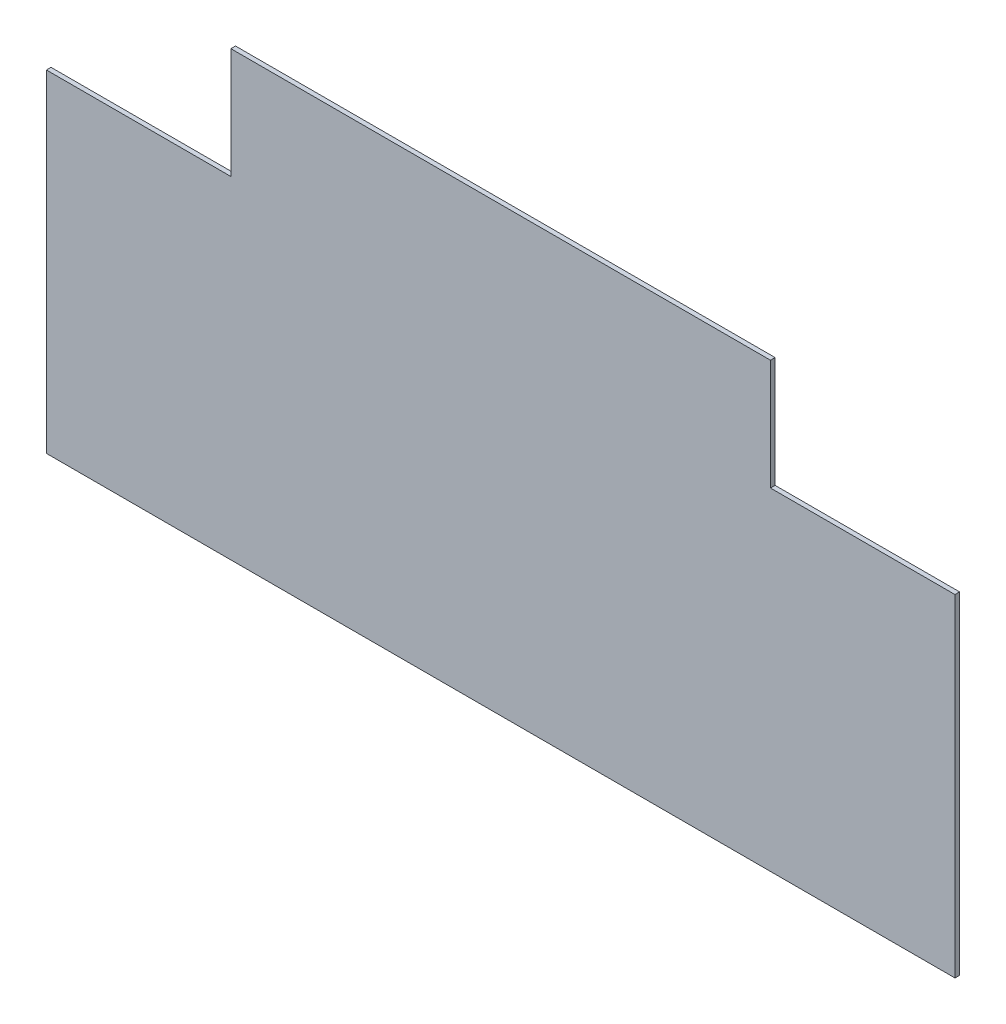
ISO-10303-21;
HEADER;
FILE_DESCRIPTION(('STEP AP214'),'2;1');
FILE_NAME('part.step','',(''),(''),'','','');
FILE_SCHEMA(('AUTOMOTIVE_DESIGN { 1 0 10303 214 1 1 1 1 }'));
ENDSEC;
DATA;
#1=APPLICATION_CONTEXT('core data for automotive mechanical design processes');
#2=APPLICATION_PROTOCOL_DEFINITION('international standard','automotive_design',2000,#1);
#3=PRODUCT_CONTEXT('',#1,'mechanical');
#4=PRODUCT('Part','Part','',(#3));
#5=PRODUCT_RELATED_PRODUCT_CATEGORY('part','',(#4));
#6=PRODUCT_DEFINITION_FORMATION('','',#4);
#7=PRODUCT_DEFINITION_CONTEXT('part definition',#1,'design');
#8=PRODUCT_DEFINITION('design','',#6,#7);
#9=PRODUCT_DEFINITION_SHAPE('','',#8);
#10=(LENGTH_UNIT() NAMED_UNIT(*) SI_UNIT(.MILLI.,.METRE.));
#11=(NAMED_UNIT(*) PLANE_ANGLE_UNIT() SI_UNIT($,.RADIAN.));
#12=(NAMED_UNIT(*) SI_UNIT($,.STERADIAN.) SOLID_ANGLE_UNIT());
#13=UNCERTAINTY_MEASURE_WITH_UNIT(LENGTH_MEASURE(1.E-05),#10,'distance_accuracy_value','');
#14=(GEOMETRIC_REPRESENTATION_CONTEXT(3) GLOBAL_UNCERTAINTY_ASSIGNED_CONTEXT((#13)) GLOBAL_UNIT_ASSIGNED_CONTEXT((#10,
#11,#12)) REPRESENTATION_CONTEXT('',''));
#15=CARTESIAN_POINT('',(0.,0.,0.));
#16=DIRECTION('',(0.,0.,1.));
#17=DIRECTION('',(1.,0.,0.));
#18=AXIS2_PLACEMENT_3D('',#15,#16,#17);
#19=CARTESIAN_POINT('',(0.,0.,3.175));
#20=DIRECTION('',(1.,0.,0.));
#21=DIRECTION('',(0.,0.,-1.));
#22=AXIS2_PLACEMENT_3D('',#19,#20,#21);
#23=PLANE('',#22);
#24=DIRECTION('',(0.,-1.,0.));
#25=VECTOR('',#24,1.);
#26=CARTESIAN_POINT('',(0.,0.,0.));
#27=LINE('',#26,#25);
#28=CARTESIAN_POINT('',(0.,228.6,0.));
#29=VERTEX_POINT('',#28);
#30=CARTESIAN_POINT('',(0.,0.,0.));
#31=VERTEX_POINT('',#30);
#32=EDGE_CURVE('E129',#29,#31,#27,.T.);
#33=ORIENTED_EDGE('',*,*,#32,.T.);
#34=DIRECTION('',(0.,0.,-1.));
#35=VECTOR('',#34,1.);
#36=CARTESIAN_POINT('',(0.,0.,3.175));
#37=LINE('',#36,#35);
#38=CARTESIAN_POINT('',(0.,0.,3.175));
#39=VERTEX_POINT('',#38);
#40=EDGE_CURVE('E11',#39,#31,#37,.T.);
#41=ORIENTED_EDGE('',*,*,#40,.F.);
#42=DIRECTION('',(0.,-1.,0.));
#43=VECTOR('',#42,1.);
#44=CARTESIAN_POINT('',(0.,0.,3.175));
#45=LINE('',#44,#43);
#46=CARTESIAN_POINT('',(0.,228.6,3.175));
#47=VERTEX_POINT('',#46);
#48=EDGE_CURVE('E143',#47,#39,#45,.T.);
#49=ORIENTED_EDGE('',*,*,#48,.F.);
#50=DIRECTION('',(0.,0.,-1.));
#51=VECTOR('',#50,1.);
#52=CARTESIAN_POINT('',(0.,228.6,3.175));
#53=LINE('',#52,#51);
#54=EDGE_CURVE('E125',#47,#29,#53,.T.);
#55=ORIENTED_EDGE('',*,*,#54,.T.);
#56=EDGE_LOOP('',(#33,#41,#49,#55));
#57=FACE_BOUND('',#56,.T.);
#58=ADVANCED_FACE('F33',(#57),#23,.F.);
#59=CARTESIAN_POINT('',(0.,0.,3.175));
#60=DIRECTION('',(0.,1.,0.));
#61=DIRECTION('',(0.,0.,1.));
#62=AXIS2_PLACEMENT_3D('',#59,#60,#61);
#63=PLANE('',#62);
#64=DIRECTION('',(1.,0.,0.));
#65=VECTOR('',#64,1.);
#66=CARTESIAN_POINT('',(0.,0.,0.));
#67=LINE('',#66,#65);
#68=CARTESIAN_POINT('',(625.475,0.,0.));
#69=VERTEX_POINT('',#68);
#70=EDGE_CURVE('E132',#31,#69,#67,.T.);
#71=ORIENTED_EDGE('',*,*,#70,.T.);
#72=DIRECTION('',(0.,0.,-1.));
#73=VECTOR('',#72,1.);
#74=CARTESIAN_POINT('',(625.475,0.,3.175));
#75=LINE('',#74,#73);
#76=CARTESIAN_POINT('',(625.475,0.,3.175));
#77=VERTEX_POINT('',#76);
#78=EDGE_CURVE('E41',#77,#69,#75,.T.);
#79=ORIENTED_EDGE('',*,*,#78,.F.);
#80=DIRECTION('',(1.,0.,0.));
#81=VECTOR('',#80,1.);
#82=CARTESIAN_POINT('',(0.,0.,3.175));
#83=LINE('',#82,#81);
#84=EDGE_CURVE('E92',#39,#77,#83,.T.);
#85=ORIENTED_EDGE('',*,*,#84,.F.);
#86=ORIENTED_EDGE('',*,*,#40,.T.);
#87=EDGE_LOOP('',(#71,#79,#85,#86));
#88=FACE_BOUND('',#87,.T.);
#89=ADVANCED_FACE('F178',(#88),#63,.F.);
#90=CARTESIAN_POINT('',(625.475,0.,3.175));
#91=DIRECTION('',(-1.,0.,0.));
#92=DIRECTION('',(0.,0.,1.));
#93=AXIS2_PLACEMENT_3D('',#90,#91,#92);
#94=PLANE('',#93);
#95=DIRECTION('',(0.,1.,0.));
#96=VECTOR('',#95,1.);
#97=CARTESIAN_POINT('',(625.475,0.,0.));
#98=LINE('',#97,#96);
#99=CARTESIAN_POINT('',(625.475,228.6,0.));
#100=VERTEX_POINT('',#99);
#101=EDGE_CURVE('E134',#69,#100,#98,.T.);
#102=ORIENTED_EDGE('',*,*,#101,.T.);
#103=DIRECTION('',(0.,0.,-1.));
#104=VECTOR('',#103,1.);
#105=CARTESIAN_POINT('',(625.475,228.6,3.175));
#106=LINE('',#105,#104);
#107=CARTESIAN_POINT('',(625.475,228.6,3.175));
#108=VERTEX_POINT('',#107);
#109=EDGE_CURVE('E150',#108,#100,#106,.T.);
#110=ORIENTED_EDGE('',*,*,#109,.F.);
#111=DIRECTION('',(0.,1.,0.));
#112=VECTOR('',#111,1.);
#113=CARTESIAN_POINT('',(625.475,0.,3.175));
#114=LINE('',#113,#112);
#115=EDGE_CURVE('E158',#77,#108,#114,.T.);
#116=ORIENTED_EDGE('',*,*,#115,.F.);
#117=ORIENTED_EDGE('',*,*,#78,.T.);
#118=EDGE_LOOP('',(#102,#110,#116,#117));
#119=FACE_BOUND('',#118,.T.);
#120=ADVANCED_FACE('F156',(#119),#94,.F.);
#121=CARTESIAN_POINT('',(498.475,228.6,3.175));
#122=DIRECTION('',(0.,-1.,0.));
#123=DIRECTION('',(0.,0.,-1.));
#124=AXIS2_PLACEMENT_3D('',#121,#122,#123);
#125=PLANE('',#124);
#126=DIRECTION('',(-1.,0.,0.));
#127=VECTOR('',#126,1.);
#128=CARTESIAN_POINT('',(498.475,228.6,0.));
#129=LINE('',#128,#127);
#130=CARTESIAN_POINT('',(498.475,228.6,0.));
#131=VERTEX_POINT('',#130);
#132=EDGE_CURVE('E136',#100,#131,#129,.T.);
#133=ORIENTED_EDGE('',*,*,#132,.T.);
#134=DIRECTION('',(0.,0.,-1.));
#135=VECTOR('',#134,1.);
#136=CARTESIAN_POINT('',(498.475,228.6,3.175));
#137=LINE('',#136,#135);
#138=CARTESIAN_POINT('',(498.475,228.6,3.175));
#139=VERTEX_POINT('',#138);
#140=EDGE_CURVE('E147',#139,#131,#137,.T.);
#141=ORIENTED_EDGE('',*,*,#140,.F.);
#142=DIRECTION('',(-1.,0.,0.));
#143=VECTOR('',#142,1.);
#144=CARTESIAN_POINT('',(498.475,228.6,3.175));
#145=LINE('',#144,#143);
#146=EDGE_CURVE('E170',#108,#139,#145,.T.);
#147=ORIENTED_EDGE('',*,*,#146,.F.);
#148=ORIENTED_EDGE('',*,*,#109,.T.);
#149=EDGE_LOOP('',(#133,#141,#147,#148));
#150=FACE_BOUND('',#149,.T.);
#151=ADVANCED_FACE('F166',(#150),#125,.F.);
#152=CARTESIAN_POINT('',(498.475,228.6,3.175));
#153=DIRECTION('',(-1.,0.,0.));
#154=DIRECTION('',(0.,0.,1.));
#155=AXIS2_PLACEMENT_3D('',#152,#153,#154);
#156=PLANE('',#155);
#157=DIRECTION('',(0.,1.,0.));
#158=VECTOR('',#157,1.);
#159=CARTESIAN_POINT('',(498.475,228.6,0.));
#160=LINE('',#159,#158);
#161=CARTESIAN_POINT('',(498.475,304.8,0.));
#162=VERTEX_POINT('',#161);
#163=EDGE_CURVE('E138',#131,#162,#160,.T.);
#164=ORIENTED_EDGE('',*,*,#163,.T.);
#165=DIRECTION('',(0.,0.,-1.));
#166=VECTOR('',#165,1.);
#167=CARTESIAN_POINT('',(498.475,304.8,3.175));
#168=LINE('',#167,#166);
#169=CARTESIAN_POINT('',(498.475,304.8,3.175));
#170=VERTEX_POINT('',#169);
#171=EDGE_CURVE('E120',#170,#162,#168,.T.);
#172=ORIENTED_EDGE('',*,*,#171,.F.);
#173=DIRECTION('',(0.,1.,0.));
#174=VECTOR('',#173,1.);
#175=CARTESIAN_POINT('',(498.475,228.6,3.175));
#176=LINE('',#175,#174);
#177=EDGE_CURVE('E111',#139,#170,#176,.T.);
#178=ORIENTED_EDGE('',*,*,#177,.F.);
#179=ORIENTED_EDGE('',*,*,#140,.T.);
#180=EDGE_LOOP('',(#164,#172,#178,#179));
#181=FACE_BOUND('',#180,.T.);
#182=ADVANCED_FACE('F169',(#181),#156,.F.);
#183=CARTESIAN_POINT('',(127.,304.8,3.175));
#184=DIRECTION('',(0.,-1.,0.));
#185=DIRECTION('',(0.,0.,-1.));
#186=AXIS2_PLACEMENT_3D('',#183,#184,#185);
#187=PLANE('',#186);
#188=DIRECTION('',(-1.,0.,0.));
#189=VECTOR('',#188,1.);
#190=CARTESIAN_POINT('',(127.,304.8,0.));
#191=LINE('',#190,#189);
#192=CARTESIAN_POINT('',(127.,304.8,0.));
#193=VERTEX_POINT('',#192);
#194=EDGE_CURVE('E119',#162,#193,#191,.T.);
#195=ORIENTED_EDGE('',*,*,#194,.T.);
#196=DIRECTION('',(0.,0.,-1.));
#197=VECTOR('',#196,1.);
#198=CARTESIAN_POINT('',(127.,304.8,3.175));
#199=LINE('',#198,#197);
#200=CARTESIAN_POINT('',(127.,304.8,3.175));
#201=VERTEX_POINT('',#200);
#202=EDGE_CURVE('E116',#201,#193,#199,.T.);
#203=ORIENTED_EDGE('',*,*,#202,.F.);
#204=DIRECTION('',(-1.,0.,0.));
#205=VECTOR('',#204,1.);
#206=CARTESIAN_POINT('',(127.,304.8,3.175));
#207=LINE('',#206,#205);
#208=EDGE_CURVE('E105',#170,#201,#207,.T.);
#209=ORIENTED_EDGE('',*,*,#208,.F.);
#210=ORIENTED_EDGE('',*,*,#171,.T.);
#211=EDGE_LOOP('',(#195,#203,#209,#210));
#212=FACE_BOUND('',#211,.T.);
#213=ADVANCED_FACE('F117',(#212),#187,.F.);
#214=CARTESIAN_POINT('',(127.,228.6,3.175));
#215=DIRECTION('',(1.,0.,0.));
#216=DIRECTION('',(0.,0.,-1.));
#217=AXIS2_PLACEMENT_3D('',#214,#215,#216);
#218=PLANE('',#217);
#219=DIRECTION('',(0.,-1.,0.));
#220=VECTOR('',#219,1.);
#221=CARTESIAN_POINT('',(127.,228.6,0.));
#222=LINE('',#221,#220);
#223=CARTESIAN_POINT('',(127.,228.6,0.));
#224=VERTEX_POINT('',#223);
#225=EDGE_CURVE('E78',#193,#224,#222,.T.);
#226=ORIENTED_EDGE('',*,*,#225,.T.);
#227=DIRECTION('',(0.,0.,-1.));
#228=VECTOR('',#227,1.);
#229=CARTESIAN_POINT('',(127.,228.6,3.175));
#230=LINE('',#229,#228);
#231=CARTESIAN_POINT('',(127.,228.6,3.175));
#232=VERTEX_POINT('',#231);
#233=EDGE_CURVE('E121',#232,#224,#230,.T.);
#234=ORIENTED_EDGE('',*,*,#233,.F.);
#235=DIRECTION('',(0.,-1.,0.));
#236=VECTOR('',#235,1.);
#237=CARTESIAN_POINT('',(127.,228.6,3.175));
#238=LINE('',#237,#236);
#239=EDGE_CURVE('E109',#201,#232,#238,.T.);
#240=ORIENTED_EDGE('',*,*,#239,.F.);
#241=ORIENTED_EDGE('',*,*,#202,.T.);
#242=EDGE_LOOP('',(#226,#234,#240,#241));
#243=FACE_BOUND('',#242,.T.);
#244=ADVANCED_FACE('F123',(#243),#218,.F.);
#245=CARTESIAN_POINT('',(0.,228.6,3.175));
#246=DIRECTION('',(0.,-1.,0.));
#247=DIRECTION('',(0.,0.,-1.));
#248=AXIS2_PLACEMENT_3D('',#245,#246,#247);
#249=PLANE('',#248);
#250=DIRECTION('',(-1.,0.,0.));
#251=VECTOR('',#250,1.);
#252=CARTESIAN_POINT('',(0.,228.6,0.));
#253=LINE('',#252,#251);
#254=EDGE_CURVE('E84',#224,#29,#253,.T.);
#255=ORIENTED_EDGE('',*,*,#254,.T.);
#256=ORIENTED_EDGE('',*,*,#54,.F.);
#257=DIRECTION('',(-1.,0.,0.));
#258=VECTOR('',#257,1.);
#259=CARTESIAN_POINT('',(0.,228.6,3.175));
#260=LINE('',#259,#258);
#261=EDGE_CURVE('E49',#232,#47,#260,.T.);
#262=ORIENTED_EDGE('',*,*,#261,.F.);
#263=ORIENTED_EDGE('',*,*,#233,.T.);
#264=EDGE_LOOP('',(#255,#256,#262,#263));
#265=FACE_BOUND('',#264,.T.);
#266=ADVANCED_FACE('F194',(#265),#249,.F.);
#267=CARTESIAN_POINT('',(0.,0.,3.175));
#268=DIRECTION('',(0.,0.,-1.));
#269=DIRECTION('',(-1.,0.,0.));
#270=AXIS2_PLACEMENT_3D('',#267,#268,#269);
#271=PLANE('',#270);
#272=ORIENTED_EDGE('',*,*,#48,.T.);
#273=ORIENTED_EDGE('',*,*,#84,.T.);
#274=ORIENTED_EDGE('',*,*,#115,.T.);
#275=ORIENTED_EDGE('',*,*,#146,.T.);
#276=ORIENTED_EDGE('',*,*,#177,.T.);
#277=ORIENTED_EDGE('',*,*,#208,.T.);
#278=ORIENTED_EDGE('',*,*,#239,.T.);
#279=ORIENTED_EDGE('',*,*,#261,.T.);
#280=EDGE_LOOP('',(#272,#273,#274,#275,#276,#277,#278,#279));
#281=FACE_BOUND('',#280,.T.);
#282=ADVANCED_FACE('F107',(#281),#271,.F.);
#283=CARTESIAN_POINT('',(0.,0.,0.));
#284=DIRECTION('',(0.,0.,-1.));
#285=DIRECTION('',(-1.,0.,0.));
#286=AXIS2_PLACEMENT_3D('',#283,#284,#285);
#287=PLANE('',#286);
#288=ORIENTED_EDGE('',*,*,#32,.F.);
#289=ORIENTED_EDGE('',*,*,#254,.F.);
#290=ORIENTED_EDGE('',*,*,#225,.F.);
#291=ORIENTED_EDGE('',*,*,#194,.F.);
#292=ORIENTED_EDGE('',*,*,#163,.F.);
#293=ORIENTED_EDGE('',*,*,#132,.F.);
#294=ORIENTED_EDGE('',*,*,#101,.F.);
#295=ORIENTED_EDGE('',*,*,#70,.F.);
#296=EDGE_LOOP('',(#288,#289,#290,#291,#292,#293,#294,#295));
#297=FACE_BOUND('',#296,.T.);
#298=ADVANCED_FACE('F162',(#297),#287,.T.);
#299=CLOSED_SHELL('',(#58,#89,#120,#151,#182,#213,#244,#266,#282,#298));
#300=MANIFOLD_SOLID_BREP('B2',#299);
#301=ADVANCED_BREP_SHAPE_REPRESENTATION('',(#18,#300),#14);
#302=SHAPE_DEFINITION_REPRESENTATION(#9,#301);
ENDSEC;
END-ISO-10303-21;
